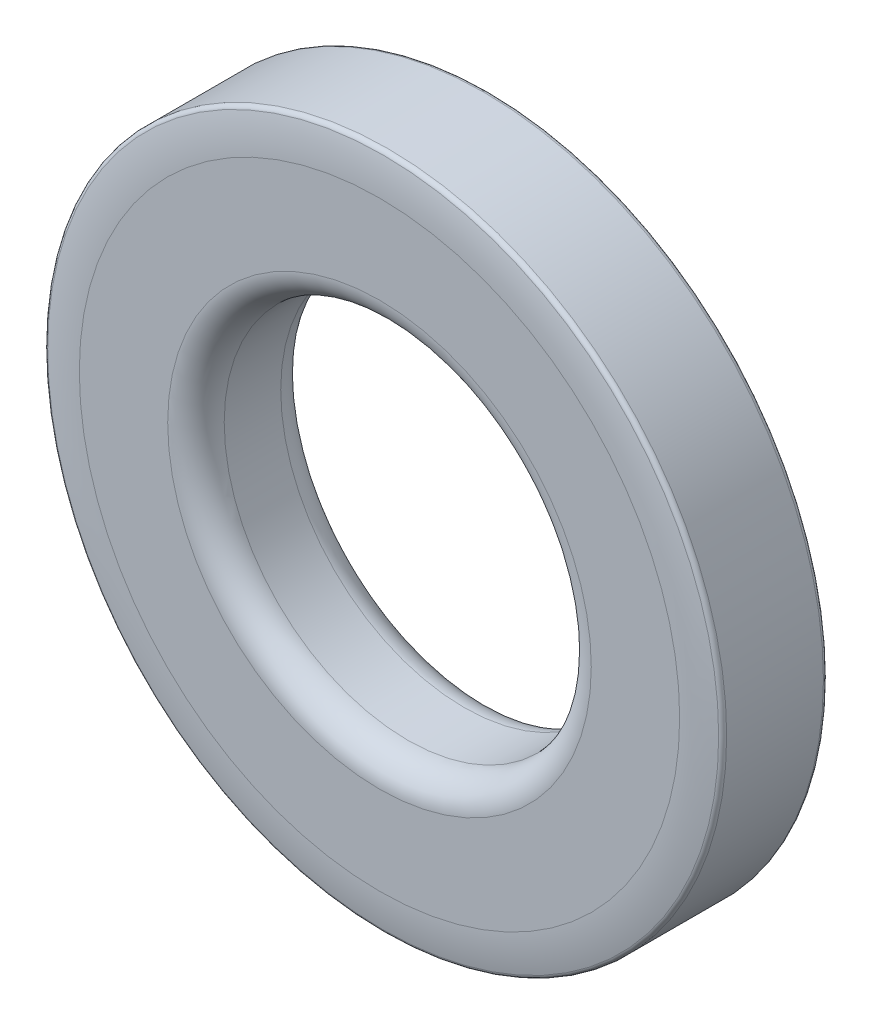
ISO-10303-21;
HEADER;
FILE_DESCRIPTION(('STEP AP214'),'2;1');
FILE_NAME('part.step','',(''),(''),'','','');
FILE_SCHEMA(('AUTOMOTIVE_DESIGN { 1 0 10303 214 1 1 1 1 }'));
ENDSEC;
DATA;
#1=APPLICATION_CONTEXT('core data for automotive mechanical design processes');
#2=APPLICATION_PROTOCOL_DEFINITION('international standard','automotive_design',2000,#1);
#3=PRODUCT_CONTEXT('',#1,'mechanical');
#4=PRODUCT('Part','Part','',(#3));
#5=PRODUCT_RELATED_PRODUCT_CATEGORY('part','',(#4));
#6=PRODUCT_DEFINITION_FORMATION('','',#4);
#7=PRODUCT_DEFINITION_CONTEXT('part definition',#1,'design');
#8=PRODUCT_DEFINITION('design','',#6,#7);
#9=PRODUCT_DEFINITION_SHAPE('','',#8);
#10=(LENGTH_UNIT() NAMED_UNIT(*) SI_UNIT(.MILLI.,.METRE.));
#11=(NAMED_UNIT(*) PLANE_ANGLE_UNIT() SI_UNIT($,.RADIAN.));
#12=(NAMED_UNIT(*) SI_UNIT($,.STERADIAN.) SOLID_ANGLE_UNIT());
#13=UNCERTAINTY_MEASURE_WITH_UNIT(LENGTH_MEASURE(1.E-05),#10,'distance_accuracy_value','');
#14=(GEOMETRIC_REPRESENTATION_CONTEXT(3) GLOBAL_UNCERTAINTY_ASSIGNED_CONTEXT((#13)) GLOBAL_UNIT_ASSIGNED_CONTEXT((#10,
#11,#12)) REPRESENTATION_CONTEXT('',''));
#15=CARTESIAN_POINT('',(0.,0.,0.));
#16=DIRECTION('',(0.,0.,1.));
#17=DIRECTION('',(1.,0.,0.));
#18=AXIS2_PLACEMENT_3D('',#15,#16,#17);
#19=CARTESIAN_POINT('',(0.,0.,1.5875));
#20=DIRECTION('',(0.,0.,-1.));
#21=DIRECTION('',(-1.,0.,0.));
#22=AXIS2_PLACEMENT_3D('',#19,#20,#21);
#23=CYLINDRICAL_SURFACE('',#22,9.525);
#24=CARTESIAN_POINT('',(0.,0.,-1.35884304896947));
#25=DIRECTION('',(0.,0.,-1.));
#26=DIRECTION('',(0.,1.,0.));
#27=AXIS2_PLACEMENT_3D('',#24,#25,#26);
#28=CIRCLE('',#27,9.525);
#29=CARTESIAN_POINT('',(0.,9.525,-1.35884304896947));
#30=VERTEX_POINT('',#29);
#31=EDGE_CURVE('E46',#30,#30,#28,.F.);
#32=ORIENTED_EDGE('',*,*,#31,.T.);
#33=EDGE_LOOP('',(#32));
#34=FACE_BOUND('',#33,.T.);
#35=CARTESIAN_POINT('',(0.,0.,1.35884304896947));
#36=DIRECTION('',(0.,0.,-1.));
#37=DIRECTION('',(0.,1.,0.));
#38=AXIS2_PLACEMENT_3D('',#35,#36,#37);
#39=CIRCLE('',#38,9.525);
#40=CARTESIAN_POINT('',(0.,9.525,1.35884304896947));
#41=VERTEX_POINT('',#40);
#42=EDGE_CURVE('E52',#41,#41,#39,.T.);
#43=ORIENTED_EDGE('',*,*,#42,.T.);
#44=EDGE_LOOP('',(#43));
#45=FACE_BOUND('',#44,.T.);
#46=ADVANCED_FACE('F32',(#34,#45),#23,.T.);
#47=CARTESIAN_POINT('',(0.,0.,1.5875));
#48=DIRECTION('',(0.,0.,-1.));
#49=DIRECTION('',(-1.,0.,0.));
#50=AXIS2_PLACEMENT_3D('',#47,#48,#49);
#51=CYLINDRICAL_SURFACE('',#50,5.1562);
#52=CARTESIAN_POINT('',(0.,0.,-0.793749999999999));
#53=DIRECTION('',(0.,0.,1.));
#54=DIRECTION('',(0.,-1.,0.));
#55=AXIS2_PLACEMENT_3D('',#52,#53,#54);
#56=CIRCLE('',#55,5.1562);
#57=CARTESIAN_POINT('',(0.,-5.1562,-0.793749999999998));
#58=VERTEX_POINT('',#57);
#59=EDGE_CURVE('E72',#58,#58,#56,.T.);
#60=ORIENTED_EDGE('',*,*,#59,.F.);
#61=EDGE_LOOP('',(#60));
#62=FACE_BOUND('',#61,.T.);
#63=CARTESIAN_POINT('',(0.,0.,0.793749999999999));
#64=DIRECTION('',(0.,0.,1.));
#65=DIRECTION('',(0.,-1.,0.));
#66=AXIS2_PLACEMENT_3D('',#63,#64,#65);
#67=CIRCLE('',#66,5.1562);
#68=CARTESIAN_POINT('',(0.,-5.1562,0.793749999999998));
#69=VERTEX_POINT('',#68);
#70=EDGE_CURVE('E63',#69,#69,#67,.T.);
#71=ORIENTED_EDGE('',*,*,#70,.T.);
#72=EDGE_LOOP('',(#71));
#73=FACE_BOUND('',#72,.T.);
#74=ADVANCED_FACE('F78',(#62,#73),#51,.F.);
#75=CARTESIAN_POINT('',(0.,0.,0.793749999999999));
#76=DIRECTION('',(0.,0.,1.));
#77=DIRECTION('',(0.,-1.,0.));
#78=AXIS2_PLACEMENT_3D('',#75,#76,#77);
#79=TOROIDAL_SURFACE('',#78,5.94995,0.793750000000001);
#80=CARTESIAN_POINT('',(0.,0.,1.5875));
#81=DIRECTION('',(0.,0.,1.));
#82=DIRECTION('',(0.,-1.,0.));
#83=AXIS2_PLACEMENT_3D('',#80,#81,#82);
#84=CIRCLE('',#83,5.94995);
#85=CARTESIAN_POINT('',(0.,-5.94995,1.5875));
#86=VERTEX_POINT('',#85);
#87=EDGE_CURVE('E60',#86,#86,#84,.T.);
#88=ORIENTED_EDGE('',*,*,#87,.T.);
#89=EDGE_LOOP('',(#88));
#90=FACE_BOUND('',#89,.T.);
#91=ORIENTED_EDGE('',*,*,#70,.F.);
#92=EDGE_LOOP('',(#91));
#93=FACE_BOUND('',#92,.T.);
#94=ADVANCED_FACE('F81',(#90,#93),#79,.T.);
#95=CARTESIAN_POINT('',(0.,0.,-3.17246));
#96=DIRECTION('',(0.,0.,1.));
#97=DIRECTION('',(0.,-1.,0.));
#98=AXIS2_PLACEMENT_3D('',#95,#96,#97);
#99=TOROIDAL_SURFACE('',#98,8.4328,4.75996);
#100=CARTESIAN_POINT('',(0.,0.,1.48305640009257));
#101=DIRECTION('',(0.,0.,-1.));
#102=DIRECTION('',(0.,1.,0.));
#103=AXIS2_PLACEMENT_3D('',#100,#101,#102);
#104=CIRCLE('',#103,9.42445833333334);
#105=CARTESIAN_POINT('',(0.,9.42445833333334,1.48305640009257));
#106=VERTEX_POINT('',#105);
#107=EDGE_CURVE('E10',#106,#106,#104,.F.);
#108=ORIENTED_EDGE('',*,*,#107,.T.);
#109=EDGE_LOOP('',(#108));
#110=FACE_BOUND('',#109,.T.);
#111=CARTESIAN_POINT('',(0.,0.,1.5875));
#112=DIRECTION('',(0.,0.,1.));
#113=DIRECTION('',(0.,-1.,0.));
#114=AXIS2_PLACEMENT_3D('',#111,#112,#113);
#115=CIRCLE('',#114,8.4328);
#116=CARTESIAN_POINT('',(0.,-8.4328,1.5875));
#117=VERTEX_POINT('',#116);
#118=EDGE_CURVE('E57',#117,#117,#115,.T.);
#119=ORIENTED_EDGE('',*,*,#118,.F.);
#120=EDGE_LOOP('',(#119));
#121=FACE_BOUND('',#120,.T.);
#122=ADVANCED_FACE('F86',(#110,#121),#99,.T.);
#123=CARTESIAN_POINT('',(0.,0.,1.5875));
#124=DIRECTION('',(0.,0.,1.));
#125=DIRECTION('',(1.,0.,0.));
#126=AXIS2_PLACEMENT_3D('',#123,#124,#125);
#127=PLANE('',#126);
#128=ORIENTED_EDGE('',*,*,#87,.F.);
#129=EDGE_LOOP('',(#128));
#130=FACE_BOUND('',#129,.T.);
#131=ORIENTED_EDGE('',*,*,#118,.T.);
#132=EDGE_LOOP('',(#131));
#133=FACE_BOUND('',#132,.T.);
#134=ADVANCED_FACE('F92',(#130,#133),#127,.T.);
#135=CARTESIAN_POINT('',(0.,0.,3.17246));
#136=DIRECTION('',(0.,0.,-1.));
#137=DIRECTION('',(0.,-1.,0.));
#138=AXIS2_PLACEMENT_3D('',#135,#136,#137);
#139=TOROIDAL_SURFACE('',#138,8.4328,4.75996);
#140=CARTESIAN_POINT('',(0.,0.,-1.48305640009257));
#141=DIRECTION('',(0.,0.,1.));
#142=DIRECTION('',(0.,-1.,0.));
#143=AXIS2_PLACEMENT_3D('',#140,#141,#142);
#144=CIRCLE('',#143,9.42445833333334);
#145=CARTESIAN_POINT('',(0.,-9.42445833333334,-1.48305640009257));
#146=VERTEX_POINT('',#145);
#147=EDGE_CURVE('E40',#146,#146,#144,.F.);
#148=ORIENTED_EDGE('',*,*,#147,.T.);
#149=EDGE_LOOP('',(#148));
#150=FACE_BOUND('',#149,.T.);
#151=CARTESIAN_POINT('',(0.,0.,-1.5875));
#152=DIRECTION('',(0.,0.,1.));
#153=DIRECTION('',(0.,-1.,0.));
#154=AXIS2_PLACEMENT_3D('',#151,#152,#153);
#155=CIRCLE('',#154,8.4328);
#156=CARTESIAN_POINT('',(0.,-8.4328,-1.5875));
#157=VERTEX_POINT('',#156);
#158=EDGE_CURVE('E66',#157,#157,#155,.T.);
#159=ORIENTED_EDGE('',*,*,#158,.T.);
#160=EDGE_LOOP('',(#159));
#161=FACE_BOUND('',#160,.T.);
#162=ADVANCED_FACE('F118',(#150,#161),#139,.T.);
#163=CARTESIAN_POINT('',(0.,0.,-0.793749999999999));
#164=DIRECTION('',(0.,0.,-1.));
#165=DIRECTION('',(0.,-1.,0.));
#166=AXIS2_PLACEMENT_3D('',#163,#164,#165);
#167=TOROIDAL_SURFACE('',#166,5.94995,0.793750000000001);
#168=CARTESIAN_POINT('',(0.,0.,-1.5875));
#169=DIRECTION('',(0.,0.,1.));
#170=DIRECTION('',(0.,-1.,0.));
#171=AXIS2_PLACEMENT_3D('',#168,#169,#170);
#172=CIRCLE('',#171,5.94995);
#173=CARTESIAN_POINT('',(0.,-5.94995,-1.5875));
#174=VERTEX_POINT('',#173);
#175=EDGE_CURVE('E69',#174,#174,#172,.T.);
#176=ORIENTED_EDGE('',*,*,#175,.F.);
#177=EDGE_LOOP('',(#176));
#178=FACE_BOUND('',#177,.T.);
#179=ORIENTED_EDGE('',*,*,#59,.T.);
#180=EDGE_LOOP('',(#179));
#181=FACE_BOUND('',#180,.T.);
#182=ADVANCED_FACE('F76',(#178,#181),#167,.T.);
#183=CARTESIAN_POINT('',(0.,0.,-1.5875));
#184=DIRECTION('',(0.,0.,1.));
#185=DIRECTION('',(1.,0.,0.));
#186=AXIS2_PLACEMENT_3D('',#183,#184,#185);
#187=PLANE('',#186);
#188=ORIENTED_EDGE('',*,*,#158,.F.);
#189=EDGE_LOOP('',(#188));
#190=FACE_BOUND('',#189,.T.);
#191=ORIENTED_EDGE('',*,*,#175,.T.);
#192=EDGE_LOOP('',(#191));
#193=FACE_BOUND('',#192,.T.);
#194=ADVANCED_FACE('F102',(#190,#193),#187,.F.);
#195=CARTESIAN_POINT('',(0.,0.,-1.35884304896947));
#196=DIRECTION('',(0.,0.,-1.));
#197=DIRECTION('',(0.,1.,0.));
#198=AXIS2_PLACEMENT_3D('',#195,#196,#197);
#199=TOROIDAL_SURFACE('',#198,9.398,0.127);
#200=ORIENTED_EDGE('',*,*,#147,.F.);
#201=EDGE_LOOP('',(#200));
#202=FACE_BOUND('',#201,.T.);
#203=ORIENTED_EDGE('',*,*,#31,.F.);
#204=EDGE_LOOP('',(#203));
#205=FACE_BOUND('',#204,.T.);
#206=ADVANCED_FACE('F104',(#202,#205),#199,.T.);
#207=CARTESIAN_POINT('',(0.,0.,1.35884304896947));
#208=DIRECTION('',(0.,0.,-1.));
#209=DIRECTION('',(0.,1.,0.));
#210=AXIS2_PLACEMENT_3D('',#207,#208,#209);
#211=TOROIDAL_SURFACE('',#210,9.398,0.127);
#212=ORIENTED_EDGE('',*,*,#42,.F.);
#213=EDGE_LOOP('',(#212));
#214=FACE_BOUND('',#213,.T.);
#215=ORIENTED_EDGE('',*,*,#107,.F.);
#216=EDGE_LOOP('',(#215));
#217=FACE_BOUND('',#216,.T.);
#218=ADVANCED_FACE('F34',(#214,#217),#211,.T.);
#219=CLOSED_SHELL('',(#46,#74,#94,#122,#134,#162,#182,#194,#206,#218));
#220=MANIFOLD_SOLID_BREP('B2',#219);
#221=ADVANCED_BREP_SHAPE_REPRESENTATION('',(#18,#220),#14);
#222=SHAPE_DEFINITION_REPRESENTATION(#9,#221);
ENDSEC;
END-ISO-10303-21;
